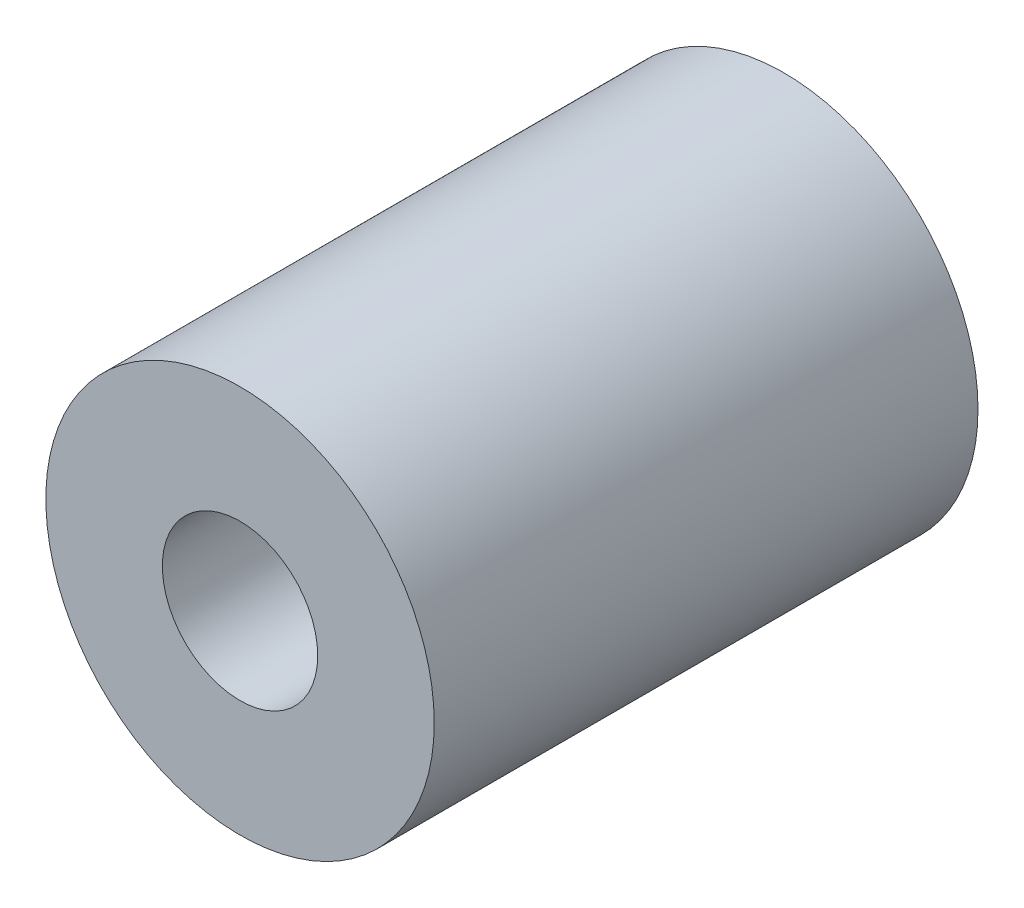
ISO-10303-21;
HEADER;
FILE_DESCRIPTION(('STEP AP214'),'2;1');
FILE_NAME('part.step','',(''),(''),'','','');
FILE_SCHEMA(('AUTOMOTIVE_DESIGN { 1 0 10303 214 1 1 1 1 }'));
ENDSEC;
DATA;
#1=APPLICATION_CONTEXT('core data for automotive mechanical design processes');
#2=APPLICATION_PROTOCOL_DEFINITION('international standard','automotive_design',2000,#1);
#3=PRODUCT_CONTEXT('',#1,'mechanical');
#4=PRODUCT('Part','Part','',(#3));
#5=PRODUCT_RELATED_PRODUCT_CATEGORY('part','',(#4));
#6=PRODUCT_DEFINITION_FORMATION('','',#4);
#7=PRODUCT_DEFINITION_CONTEXT('part definition',#1,'design');
#8=PRODUCT_DEFINITION('design','',#6,#7);
#9=PRODUCT_DEFINITION_SHAPE('','',#8);
#10=(LENGTH_UNIT() NAMED_UNIT(*) SI_UNIT(.MILLI.,.METRE.));
#11=(NAMED_UNIT(*) PLANE_ANGLE_UNIT() SI_UNIT($,.RADIAN.));
#12=(NAMED_UNIT(*) SI_UNIT($,.STERADIAN.) SOLID_ANGLE_UNIT());
#13=UNCERTAINTY_MEASURE_WITH_UNIT(LENGTH_MEASURE(1.E-05),#10,'distance_accuracy_value','');
#14=(GEOMETRIC_REPRESENTATION_CONTEXT(3) GLOBAL_UNCERTAINTY_ASSIGNED_CONTEXT((#13)) GLOBAL_UNIT_ASSIGNED_CONTEXT((#10,
#11,#12)) REPRESENTATION_CONTEXT('',''));
#15=CARTESIAN_POINT('',(0.,0.,0.));
#16=DIRECTION('',(0.,0.,1.));
#17=DIRECTION('',(1.,0.,0.));
#18=AXIS2_PLACEMENT_3D('',#15,#16,#17);
#19=CARTESIAN_POINT('',(0.,0.,14.));
#20=DIRECTION('',(0.,0.,-1.));
#21=DIRECTION('',(-1.,0.,0.));
#22=AXIS2_PLACEMENT_3D('',#19,#20,#21);
#23=CYLINDRICAL_SURFACE('',#22,5.);
#24=CARTESIAN_POINT('',(0.,0.,14.));
#25=DIRECTION('',(0.,0.,1.));
#26=DIRECTION('',(1.,0.,0.));
#27=AXIS2_PLACEMENT_3D('',#24,#25,#26);
#28=CIRCLE('',#27,5.);
#29=CARTESIAN_POINT('',(5.,0.,14.));
#30=VERTEX_POINT('',#29);
#31=EDGE_CURVE('E10',#30,#30,#28,.T.);
#32=ORIENTED_EDGE('',*,*,#31,.F.);
#33=EDGE_LOOP('',(#32));
#34=FACE_BOUND('',#33,.T.);
#35=CARTESIAN_POINT('',(0.,0.,0.));
#36=DIRECTION('',(0.,0.,1.));
#37=DIRECTION('',(1.,0.,0.));
#38=AXIS2_PLACEMENT_3D('',#35,#36,#37);
#39=CIRCLE('',#38,5.);
#40=CARTESIAN_POINT('',(5.,0.,0.));
#41=VERTEX_POINT('',#40);
#42=EDGE_CURVE('E38',#41,#41,#39,.T.);
#43=ORIENTED_EDGE('',*,*,#42,.T.);
#44=EDGE_LOOP('',(#43));
#45=FACE_BOUND('',#44,.T.);
#46=ADVANCED_FACE('F35',(#34,#45),#23,.T.);
#47=CARTESIAN_POINT('',(0.,0.,14.));
#48=DIRECTION('',(0.,0.,1.));
#49=DIRECTION('',(1.,0.,0.));
#50=AXIS2_PLACEMENT_3D('',#47,#48,#49);
#51=PLANE('',#50);
#52=CARTESIAN_POINT('',(0.,0.,14.));
#53=DIRECTION('',(0.,0.,1.));
#54=DIRECTION('',(1.,0.,0.));
#55=AXIS2_PLACEMENT_3D('',#52,#53,#54);
#56=CIRCLE('',#55,2.);
#57=CARTESIAN_POINT('',(2.,0.,14.));
#58=VERTEX_POINT('',#57);
#59=EDGE_CURVE('E49',#58,#58,#56,.T.);
#60=ORIENTED_EDGE('',*,*,#59,.F.);
#61=EDGE_LOOP('',(#60));
#62=FACE_BOUND('',#61,.T.);
#63=ORIENTED_EDGE('',*,*,#31,.T.);
#64=EDGE_LOOP('',(#63));
#65=FACE_BOUND('',#64,.T.);
#66=ADVANCED_FACE('F55',(#62,#65),#51,.T.);
#67=CARTESIAN_POINT('',(0.,0.,0.));
#68=DIRECTION('',(0.,0.,1.));
#69=DIRECTION('',(1.,0.,0.));
#70=AXIS2_PLACEMENT_3D('',#67,#68,#69);
#71=PLANE('',#70);
#72=CARTESIAN_POINT('',(0.,0.,0.));
#73=DIRECTION('',(0.,0.,1.));
#74=DIRECTION('',(1.,0.,0.));
#75=AXIS2_PLACEMENT_3D('',#72,#73,#74);
#76=CIRCLE('',#75,2.);
#77=CARTESIAN_POINT('',(2.,0.,0.));
#78=VERTEX_POINT('',#77);
#79=EDGE_CURVE('E45',#78,#78,#76,.T.);
#80=ORIENTED_EDGE('',*,*,#79,.T.);
#81=EDGE_LOOP('',(#80));
#82=FACE_BOUND('',#81,.T.);
#83=ORIENTED_EDGE('',*,*,#42,.F.);
#84=EDGE_LOOP('',(#83));
#85=FACE_BOUND('',#84,.T.);
#86=ADVANCED_FACE('F57',(#82,#85),#71,.F.);
#87=CARTESIAN_POINT('',(0.,0.,14.));
#88=DIRECTION('',(0.,0.,1.));
#89=DIRECTION('',(1.,0.,0.));
#90=AXIS2_PLACEMENT_3D('',#87,#88,#89);
#91=CYLINDRICAL_SURFACE('',#90,2.);
#92=ORIENTED_EDGE('',*,*,#79,.F.);
#93=EDGE_LOOP('',(#92));
#94=FACE_BOUND('',#93,.T.);
#95=ORIENTED_EDGE('',*,*,#59,.T.);
#96=EDGE_LOOP('',(#95));
#97=FACE_BOUND('',#96,.T.);
#98=ADVANCED_FACE('F53',(#94,#97),#91,.F.);
#99=CLOSED_SHELL('',(#46,#66,#86,#98));
#100=MANIFOLD_SOLID_BREP('B2',#99);
#101=ADVANCED_BREP_SHAPE_REPRESENTATION('',(#18,#100),#14);
#102=SHAPE_DEFINITION_REPRESENTATION(#9,#101);
ENDSEC;
END-ISO-10303-21;
